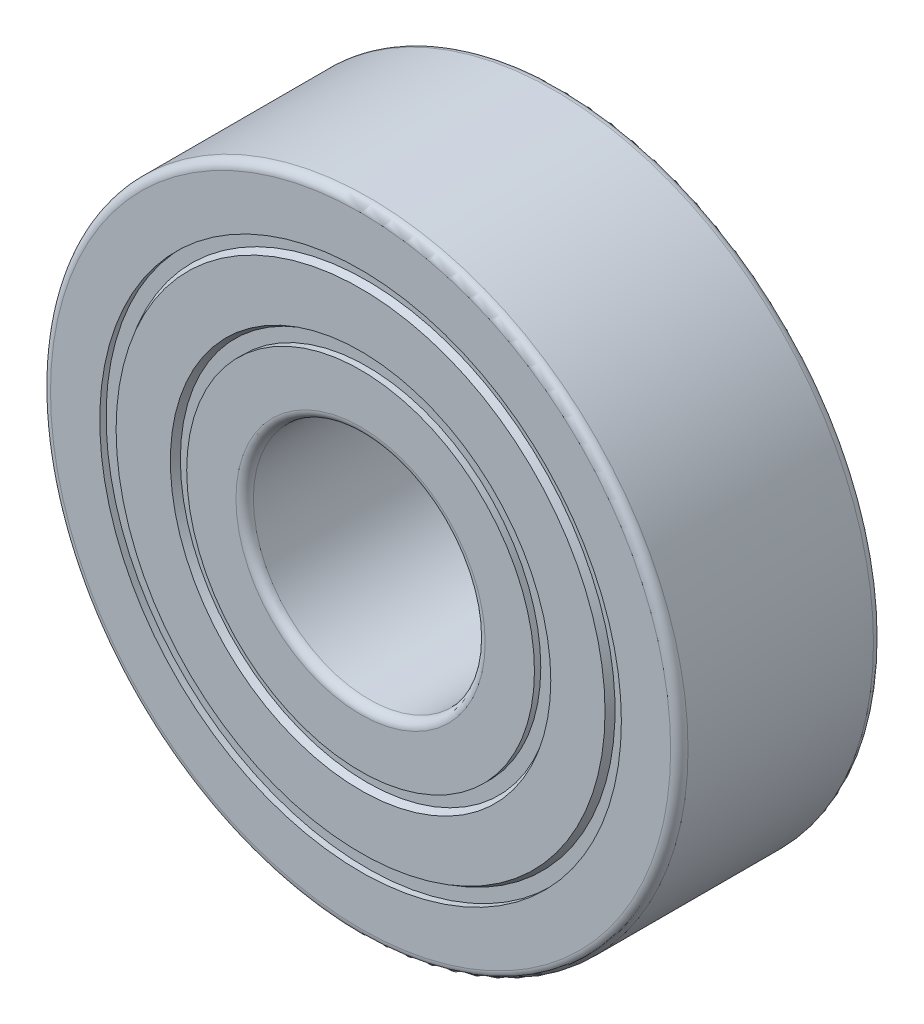
ISO-10303-21;
HEADER;
FILE_DESCRIPTION(('STEP AP214'),'2;1');
FILE_NAME('part.step','',(''),(''),'','','');
FILE_SCHEMA(('AUTOMOTIVE_DESIGN { 1 0 10303 214 1 1 1 1 }'));
ENDSEC;
DATA;
#1=APPLICATION_CONTEXT('core data for automotive mechanical design processes');
#2=APPLICATION_PROTOCOL_DEFINITION('international standard','automotive_design',2000,#1);
#3=PRODUCT_CONTEXT('',#1,'mechanical');
#4=PRODUCT('Part','Part','',(#3));
#5=PRODUCT_RELATED_PRODUCT_CATEGORY('part','',(#4));
#6=PRODUCT_DEFINITION_FORMATION('','',#4);
#7=PRODUCT_DEFINITION_CONTEXT('part definition',#1,'design');
#8=PRODUCT_DEFINITION('design','',#6,#7);
#9=PRODUCT_DEFINITION_SHAPE('','',#8);
#10=(LENGTH_UNIT() NAMED_UNIT(*) SI_UNIT(.MILLI.,.METRE.));
#11=(NAMED_UNIT(*) PLANE_ANGLE_UNIT() SI_UNIT($,.RADIAN.));
#12=(NAMED_UNIT(*) SI_UNIT($,.STERADIAN.) SOLID_ANGLE_UNIT());
#13=UNCERTAINTY_MEASURE_WITH_UNIT(LENGTH_MEASURE(1.E-05),#10,'distance_accuracy_value','');
#14=(GEOMETRIC_REPRESENTATION_CONTEXT(3) GLOBAL_UNCERTAINTY_ASSIGNED_CONTEXT((#13)) GLOBAL_UNIT_ASSIGNED_CONTEXT((#10,
#11,#12)) REPRESENTATION_CONTEXT('',''));
#15=CARTESIAN_POINT('',(0.,0.,0.));
#16=DIRECTION('',(0.,0.,1.));
#17=DIRECTION('',(1.,0.,0.));
#18=AXIS2_PLACEMENT_3D('',#15,#16,#17);
#19=CARTESIAN_POINT('',(0.,0.,19.));
#20=DIRECTION('',(0.,0.,1.));
#21=DIRECTION('',(1.,0.,0.));
#22=AXIS2_PLACEMENT_3D('',#19,#20,#21);
#23=CYLINDRICAL_SURFACE('',#22,4.);
#24=CARTESIAN_POINT('',(0.,0.,6.7));
#25=DIRECTION('',(0.,0.,1.));
#26=DIRECTION('',(1.,0.,0.));
#27=AXIS2_PLACEMENT_3D('',#24,#25,#26);
#28=CIRCLE('',#27,4.);
#29=CARTESIAN_POINT('',(4.,0.,6.7));
#30=VERTEX_POINT('',#29);
#31=EDGE_CURVE('E179',#30,#30,#28,.F.);
#32=ORIENTED_EDGE('',*,*,#31,.F.);
#33=EDGE_LOOP('',(#32));
#34=FACE_BOUND('',#33,.T.);
#35=CARTESIAN_POINT('',(0.,0.,0.300000000000002));
#36=DIRECTION('',(0.,0.,1.));
#37=DIRECTION('',(1.,0.,0.));
#38=AXIS2_PLACEMENT_3D('',#35,#36,#37);
#39=CIRCLE('',#38,4.);
#40=CARTESIAN_POINT('',(4.,0.,0.300000000000002));
#41=VERTEX_POINT('',#40);
#42=EDGE_CURVE('E176',#41,#41,#39,.T.);
#43=ORIENTED_EDGE('',*,*,#42,.F.);
#44=EDGE_LOOP('',(#43));
#45=FACE_BOUND('',#44,.T.);
#46=ADVANCED_FACE('F15',(#34,#45),#23,.F.);
#47=CARTESIAN_POINT('',(0.,0.,6.7));
#48=DIRECTION('',(0.,0.,1.));
#49=DIRECTION('',(1.,0.,0.));
#50=AXIS2_PLACEMENT_3D('',#47,#48,#49);
#51=TOROIDAL_SURFACE('',#50,4.3,0.3);
#52=CARTESIAN_POINT('',(0.,0.,7.));
#53=DIRECTION('',(0.,0.,1.));
#54=DIRECTION('',(-1.,0.,0.));
#55=AXIS2_PLACEMENT_3D('',#52,#53,#54);
#56=CIRCLE('',#55,4.3);
#57=CARTESIAN_POINT('',(-4.3,0.,7.));
#58=VERTEX_POINT('',#57);
#59=EDGE_CURVE('E175',#58,#58,#56,.T.);
#60=ORIENTED_EDGE('',*,*,#59,.T.);
#61=EDGE_LOOP('',(#60));
#62=FACE_BOUND('',#61,.T.);
#63=ORIENTED_EDGE('',*,*,#31,.T.);
#64=EDGE_LOOP('',(#63));
#65=FACE_BOUND('',#64,.T.);
#66=ADVANCED_FACE('F187',(#62,#65),#51,.T.);
#67=CARTESIAN_POINT('',(0.,0.,0.300000000000001));
#68=DIRECTION('',(0.,0.,1.));
#69=DIRECTION('',(1.,0.,0.));
#70=AXIS2_PLACEMENT_3D('',#67,#68,#69);
#71=TOROIDAL_SURFACE('',#70,4.3,0.3);
#72=ORIENTED_EDGE('',*,*,#42,.T.);
#73=EDGE_LOOP('',(#72));
#74=FACE_BOUND('',#73,.T.);
#75=CARTESIAN_POINT('',(0.,0.,0.));
#76=DIRECTION('',(0.,0.,-1.));
#77=DIRECTION('',(1.,0.,0.));
#78=AXIS2_PLACEMENT_3D('',#75,#76,#77);
#79=CIRCLE('',#78,4.3);
#80=CARTESIAN_POINT('',(4.3,0.,0.));
#81=VERTEX_POINT('',#80);
#82=EDGE_CURVE('E162',#81,#81,#79,.T.);
#83=ORIENTED_EDGE('',*,*,#82,.T.);
#84=EDGE_LOOP('',(#83));
#85=FACE_BOUND('',#84,.T.);
#86=ADVANCED_FACE('F183',(#74,#85),#71,.T.);
#87=CARTESIAN_POINT('',(-4.3,0.,7.));
#88=DIRECTION('',(0.,0.,-1.));
#89=DIRECTION('',(-1.,0.,0.));
#90=AXIS2_PLACEMENT_3D('',#87,#88,#89);
#91=PLANE('',#90);
#92=CARTESIAN_POINT('',(0.,0.,7.));
#93=DIRECTION('',(0.,0.,1.));
#94=DIRECTION('',(1.,0.,0.));
#95=AXIS2_PLACEMENT_3D('',#92,#93,#94);
#96=CIRCLE('',#95,6.);
#97=CARTESIAN_POINT('',(6.,0.,7.));
#98=VERTEX_POINT('',#97);
#99=EDGE_CURVE('E19',#98,#98,#96,.F.);
#100=ORIENTED_EDGE('',*,*,#99,.F.);
#101=EDGE_LOOP('',(#100));
#102=FACE_BOUND('',#101,.T.);
#103=ORIENTED_EDGE('',*,*,#59,.F.);
#104=EDGE_LOOP('',(#103));
#105=FACE_BOUND('',#104,.T.);
#106=ADVANCED_FACE('F147',(#102,#105),#91,.F.);
#107=CARTESIAN_POINT('',(-4.3,0.,0.));
#108=DIRECTION('',(0.,0.,1.));
#109=DIRECTION('',(1.,0.,0.));
#110=AXIS2_PLACEMENT_3D('',#107,#108,#109);
#111=PLANE('',#110);
#112=ORIENTED_EDGE('',*,*,#82,.F.);
#113=EDGE_LOOP('',(#112));
#114=FACE_BOUND('',#113,.T.);
#115=CARTESIAN_POINT('',(0.,0.,0.));
#116=DIRECTION('',(0.,0.,1.));
#117=DIRECTION('',(1.,0.,0.));
#118=AXIS2_PLACEMENT_3D('',#115,#116,#117);
#119=CIRCLE('',#118,6.);
#120=CARTESIAN_POINT('',(6.,0.,0.));
#121=VERTEX_POINT('',#120);
#122=EDGE_CURVE('E253',#121,#121,#119,.T.);
#123=ORIENTED_EDGE('',*,*,#122,.F.);
#124=EDGE_LOOP('',(#123));
#125=FACE_BOUND('',#124,.T.);
#126=ADVANCED_FACE('F142',(#114,#125),#111,.F.);
#127=CARTESIAN_POINT('',(0.,0.,19.));
#128=DIRECTION('',(0.,0.,1.));
#129=DIRECTION('',(1.,0.,0.));
#130=AXIS2_PLACEMENT_3D('',#127,#128,#129);
#131=CYLINDRICAL_SURFACE('',#130,6.);
#132=ORIENTED_EDGE('',*,*,#99,.T.);
#133=EDGE_LOOP('',(#132));
#134=FACE_BOUND('',#133,.T.);
#135=CARTESIAN_POINT('',(0.,0.,6.78125));
#136=DIRECTION('',(0.,0.,1.));
#137=DIRECTION('',(1.,0.,0.));
#138=AXIS2_PLACEMENT_3D('',#135,#136,#137);
#139=CIRCLE('',#138,6.);
#140=CARTESIAN_POINT('',(6.,0.,6.78125));
#141=VERTEX_POINT('',#140);
#142=EDGE_CURVE('E251',#141,#141,#139,.T.);
#143=ORIENTED_EDGE('',*,*,#142,.T.);
#144=EDGE_LOOP('',(#143));
#145=FACE_BOUND('',#144,.T.);
#146=ADVANCED_FACE('F138',(#134,#145),#131,.T.);
#147=CARTESIAN_POINT('',(0.,0.,19.));
#148=DIRECTION('',(0.,0.,1.));
#149=DIRECTION('',(1.,0.,0.));
#150=AXIS2_PLACEMENT_3D('',#147,#148,#149);
#151=CYLINDRICAL_SURFACE('',#150,6.);
#152=ORIENTED_EDGE('',*,*,#122,.T.);
#153=EDGE_LOOP('',(#152));
#154=FACE_BOUND('',#153,.T.);
#155=CARTESIAN_POINT('',(0.,0.,0.21875));
#156=DIRECTION('',(0.,0.,1.));
#157=DIRECTION('',(1.,0.,0.));
#158=AXIS2_PLACEMENT_3D('',#155,#156,#157);
#159=CIRCLE('',#158,6.);
#160=CARTESIAN_POINT('',(6.,0.,0.21875));
#161=VERTEX_POINT('',#160);
#162=EDGE_CURVE('E248',#161,#161,#159,.F.);
#163=ORIENTED_EDGE('',*,*,#162,.T.);
#164=EDGE_LOOP('',(#163));
#165=FACE_BOUND('',#164,.T.);
#166=ADVANCED_FACE('F134',(#154,#165),#151,.T.);
#167=CARTESIAN_POINT('',(-6.,0.,6.78125));
#168=DIRECTION('',(0.,0.,-1.));
#169=DIRECTION('',(-1.,0.,0.));
#170=AXIS2_PLACEMENT_3D('',#167,#168,#169);
#171=PLANE('',#170);
#172=CARTESIAN_POINT('',(0.,0.,6.78125000001728));
#173=DIRECTION('',(0.,0.,1.));
#174=DIRECTION('',(1.,0.,0.));
#175=AXIS2_PLACEMENT_3D('',#172,#173,#174);
#176=CIRCLE('',#175,6.43750000000409);
#177=CARTESIAN_POINT('',(6.43750000000409,0.,6.78125000001728));
#178=VERTEX_POINT('',#177);
#179=EDGE_CURVE('E245',#178,#178,#176,.T.);
#180=ORIENTED_EDGE('',*,*,#179,.T.);
#181=EDGE_LOOP('',(#180));
#182=FACE_BOUND('',#181,.T.);
#183=ORIENTED_EDGE('',*,*,#142,.F.);
#184=EDGE_LOOP('',(#183));
#185=FACE_BOUND('',#184,.T.);
#186=ADVANCED_FACE('F130',(#182,#185),#171,.F.);
#187=CARTESIAN_POINT('',(-6.,0.,0.21875));
#188=DIRECTION('',(0.,0.,1.));
#189=DIRECTION('',(1.,0.,0.));
#190=AXIS2_PLACEMENT_3D('',#187,#188,#189);
#191=PLANE('',#190);
#192=ORIENTED_EDGE('',*,*,#162,.F.);
#193=EDGE_LOOP('',(#192));
#194=FACE_BOUND('',#193,.T.);
#195=CARTESIAN_POINT('',(0.,0.,0.218750000044565));
#196=DIRECTION('',(0.,0.,-1.));
#197=DIRECTION('',(-1.,0.,0.));
#198=AXIS2_PLACEMENT_3D('',#195,#196,#197);
#199=CIRCLE('',#198,6.43749999998007);
#200=CARTESIAN_POINT('',(-6.43749999998007,0.,0.218750000044565));
#201=VERTEX_POINT('',#200);
#202=EDGE_CURVE('E242',#201,#201,#199,.T.);
#203=ORIENTED_EDGE('',*,*,#202,.T.);
#204=EDGE_LOOP('',(#203));
#205=FACE_BOUND('',#204,.T.);
#206=ADVANCED_FACE('F126',(#194,#205),#191,.F.);
#207=CARTESIAN_POINT('',(0.,0.,7.000000000005));
#208=DIRECTION('',(0.,0.,1.));
#209=DIRECTION('',(1.,0.,0.));
#210=AXIS2_PLACEMENT_3D('',#207,#208,#209);
#211=CONICAL_SURFACE('',#210,6.56379537139173,0.523598775630869);
#212=CARTESIAN_POINT('',(0.,0.,7.000000000005));
#213=DIRECTION('',(0.,0.,1.));
#214=DIRECTION('',(1.,0.,0.));
#215=AXIS2_PLACEMENT_3D('',#212,#213,#214);
#216=CIRCLE('',#215,6.56379537139173);
#217=CARTESIAN_POINT('',(6.56379537139173,0.,7.000000000005));
#218=VERTEX_POINT('',#217);
#219=EDGE_CURVE('E239',#218,#218,#216,.T.);
#220=ORIENTED_EDGE('',*,*,#219,.T.);
#221=EDGE_LOOP('',(#220));
#222=FACE_BOUND('',#221,.T.);
#223=ORIENTED_EDGE('',*,*,#179,.F.);
#224=EDGE_LOOP('',(#223));
#225=FACE_BOUND('',#224,.T.);
#226=ADVANCED_FACE('F122',(#222,#225),#211,.F.);
#227=CARTESIAN_POINT('',(0.,0.,0.));
#228=DIRECTION('',(0.,0.,-1.));
#229=DIRECTION('',(-1.,0.,0.));
#230=AXIS2_PLACEMENT_3D('',#227,#228,#229);
#231=CONICAL_SURFACE('',#230,6.56379537139173,0.523598775600719);
#232=ORIENTED_EDGE('',*,*,#202,.F.);
#233=EDGE_LOOP('',(#232));
#234=FACE_BOUND('',#233,.T.);
#235=CARTESIAN_POINT('',(0.,0.,0.));
#236=DIRECTION('',(0.,0.,-1.));
#237=DIRECTION('',(-1.,0.,0.));
#238=AXIS2_PLACEMENT_3D('',#235,#236,#237);
#239=CIRCLE('',#238,6.56379537139173);
#240=CARTESIAN_POINT('',(-6.56379537139173,0.,0.));
#241=VERTEX_POINT('',#240);
#242=EDGE_CURVE('E236',#241,#241,#239,.T.);
#243=ORIENTED_EDGE('',*,*,#242,.T.);
#244=EDGE_LOOP('',(#243));
#245=FACE_BOUND('',#244,.T.);
#246=ADVANCED_FACE('F118',(#234,#245),#231,.F.);
#247=CARTESIAN_POINT('',(-8.43620462861477,0.,7.));
#248=DIRECTION('',(0.,0.,-1.));
#249=DIRECTION('',(-1.,0.,0.));
#250=AXIS2_PLACEMENT_3D('',#247,#248,#249);
#251=PLANE('',#250);
#252=CARTESIAN_POINT('',(0.,0.,7.));
#253=DIRECTION('',(0.,0.,-1.));
#254=DIRECTION('',(-1.,0.,0.));
#255=AXIS2_PLACEMENT_3D('',#252,#253,#254);
#256=CIRCLE('',#255,8.43620462861477);
#257=CARTESIAN_POINT('',(-8.43620462861477,0.,7.));
#258=VERTEX_POINT('',#257);
#259=EDGE_CURVE('E233',#258,#258,#256,.T.);
#260=ORIENTED_EDGE('',*,*,#259,.F.);
#261=EDGE_LOOP('',(#260));
#262=FACE_BOUND('',#261,.T.);
#263=ORIENTED_EDGE('',*,*,#219,.F.);
#264=EDGE_LOOP('',(#263));
#265=FACE_BOUND('',#264,.T.);
#266=ADVANCED_FACE('F114',(#262,#265),#251,.F.);
#267=CARTESIAN_POINT('',(-8.43620462861477,0.,0.));
#268=DIRECTION('',(0.,0.,1.));
#269=DIRECTION('',(1.,0.,0.));
#270=AXIS2_PLACEMENT_3D('',#267,#268,#269);
#271=PLANE('',#270);
#272=ORIENTED_EDGE('',*,*,#242,.F.);
#273=EDGE_LOOP('',(#272));
#274=FACE_BOUND('',#273,.T.);
#275=CARTESIAN_POINT('',(0.,0.,0.));
#276=DIRECTION('',(0.,0.,1.));
#277=DIRECTION('',(1.,0.,0.));
#278=AXIS2_PLACEMENT_3D('',#275,#276,#277);
#279=CIRCLE('',#278,8.43620462861477);
#280=CARTESIAN_POINT('',(8.43620462861477,0.,0.));
#281=VERTEX_POINT('',#280);
#282=EDGE_CURVE('E230',#281,#281,#279,.T.);
#283=ORIENTED_EDGE('',*,*,#282,.F.);
#284=EDGE_LOOP('',(#283));
#285=FACE_BOUND('',#284,.T.);
#286=ADVANCED_FACE('F110',(#274,#285),#271,.F.);
#287=CARTESIAN_POINT('',(0.,0.,6.78125));
#288=DIRECTION('',(0.,0.,-1.));
#289=DIRECTION('',(-1.,0.,0.));
#290=AXIS2_PLACEMENT_3D('',#287,#288,#289);
#291=CONICAL_SURFACE('',#290,8.5625,0.523598775598308);
#292=CARTESIAN_POINT('',(0.,0.,6.78125));
#293=DIRECTION('',(0.,0.,-1.));
#294=DIRECTION('',(-1.,0.,0.));
#295=AXIS2_PLACEMENT_3D('',#292,#293,#294);
#296=CIRCLE('',#295,8.5625);
#297=CARTESIAN_POINT('',(-8.5625,0.,6.78125));
#298=VERTEX_POINT('',#297);
#299=EDGE_CURVE('E227',#298,#298,#296,.F.);
#300=ORIENTED_EDGE('',*,*,#299,.T.);
#301=EDGE_LOOP('',(#300));
#302=FACE_BOUND('',#301,.T.);
#303=ORIENTED_EDGE('',*,*,#259,.T.);
#304=EDGE_LOOP('',(#303));
#305=FACE_BOUND('',#304,.T.);
#306=ADVANCED_FACE('F106',(#302,#305),#291,.T.);
#307=CARTESIAN_POINT('',(0.,0.,0.21875));
#308=DIRECTION('',(0.,0.,1.));
#309=DIRECTION('',(1.,0.,0.));
#310=AXIS2_PLACEMENT_3D('',#307,#308,#309);
#311=CONICAL_SURFACE('',#310,8.5625,0.523598775598309);
#312=ORIENTED_EDGE('',*,*,#282,.T.);
#313=EDGE_LOOP('',(#312));
#314=FACE_BOUND('',#313,.T.);
#315=CARTESIAN_POINT('',(0.,0.,0.21875));
#316=DIRECTION('',(0.,0.,1.));
#317=DIRECTION('',(1.,0.,0.));
#318=AXIS2_PLACEMENT_3D('',#315,#316,#317);
#319=CIRCLE('',#318,8.5625);
#320=CARTESIAN_POINT('',(8.5625,0.,0.21875));
#321=VERTEX_POINT('',#320);
#322=EDGE_CURVE('E224',#321,#321,#319,.F.);
#323=ORIENTED_EDGE('',*,*,#322,.T.);
#324=EDGE_LOOP('',(#323));
#325=FACE_BOUND('',#324,.T.);
#326=ADVANCED_FACE('F102',(#314,#325),#311,.T.);
#327=CARTESIAN_POINT('',(-9.,0.,6.78125));
#328=DIRECTION('',(0.,0.,-1.));
#329=DIRECTION('',(-1.,0.,0.));
#330=AXIS2_PLACEMENT_3D('',#327,#328,#329);
#331=PLANE('',#330);
#332=CARTESIAN_POINT('',(0.,0.,6.78125));
#333=DIRECTION('',(0.,0.,1.));
#334=DIRECTION('',(1.,0.,0.));
#335=AXIS2_PLACEMENT_3D('',#332,#333,#334);
#336=CIRCLE('',#335,9.);
#337=CARTESIAN_POINT('',(9.,0.,6.78125));
#338=VERTEX_POINT('',#337);
#339=EDGE_CURVE('E221',#338,#338,#336,.T.);
#340=ORIENTED_EDGE('',*,*,#339,.T.);
#341=EDGE_LOOP('',(#340));
#342=FACE_BOUND('',#341,.T.);
#343=ORIENTED_EDGE('',*,*,#299,.F.);
#344=EDGE_LOOP('',(#343));
#345=FACE_BOUND('',#344,.T.);
#346=ADVANCED_FACE('F98',(#342,#345),#331,.F.);
#347=CARTESIAN_POINT('',(-9.,0.,0.21875));
#348=DIRECTION('',(0.,0.,1.));
#349=DIRECTION('',(1.,0.,0.));
#350=AXIS2_PLACEMENT_3D('',#347,#348,#349);
#351=PLANE('',#350);
#352=ORIENTED_EDGE('',*,*,#322,.F.);
#353=EDGE_LOOP('',(#352));
#354=FACE_BOUND('',#353,.T.);
#355=CARTESIAN_POINT('',(0.,0.,0.21875));
#356=DIRECTION('',(0.,0.,1.));
#357=DIRECTION('',(1.,0.,0.));
#358=AXIS2_PLACEMENT_3D('',#355,#356,#357);
#359=CIRCLE('',#358,9.);
#360=CARTESIAN_POINT('',(9.,0.,0.21875));
#361=VERTEX_POINT('',#360);
#362=EDGE_CURVE('E218',#361,#361,#359,.F.);
#363=ORIENTED_EDGE('',*,*,#362,.T.);
#364=EDGE_LOOP('',(#363));
#365=FACE_BOUND('',#364,.T.);
#366=ADVANCED_FACE('F94',(#354,#365),#351,.F.);
#367=CARTESIAN_POINT('',(0.,0.,19.));
#368=DIRECTION('',(0.,0.,1.));
#369=DIRECTION('',(1.,0.,0.));
#370=AXIS2_PLACEMENT_3D('',#367,#368,#369);
#371=CYLINDRICAL_SURFACE('',#370,9.);
#372=CARTESIAN_POINT('',(0.,0.,7.));
#373=DIRECTION('',(0.,0.,1.));
#374=DIRECTION('',(1.,0.,0.));
#375=AXIS2_PLACEMENT_3D('',#372,#373,#374);
#376=CIRCLE('',#375,9.);
#377=CARTESIAN_POINT('',(9.,0.,7.));
#378=VERTEX_POINT('',#377);
#379=EDGE_CURVE('E215',#378,#378,#376,.T.);
#380=ORIENTED_EDGE('',*,*,#379,.T.);
#381=EDGE_LOOP('',(#380));
#382=FACE_BOUND('',#381,.T.);
#383=ORIENTED_EDGE('',*,*,#339,.F.);
#384=EDGE_LOOP('',(#383));
#385=FACE_BOUND('',#384,.T.);
#386=ADVANCED_FACE('F90',(#382,#385),#371,.F.);
#387=CARTESIAN_POINT('',(0.,0.,19.));
#388=DIRECTION('',(0.,0.,1.));
#389=DIRECTION('',(1.,0.,0.));
#390=AXIS2_PLACEMENT_3D('',#387,#388,#389);
#391=CYLINDRICAL_SURFACE('',#390,9.);
#392=ORIENTED_EDGE('',*,*,#362,.F.);
#393=EDGE_LOOP('',(#392));
#394=FACE_BOUND('',#393,.T.);
#395=CARTESIAN_POINT('',(0.,0.,0.));
#396=DIRECTION('',(0.,0.,1.));
#397=DIRECTION('',(1.,0.,0.));
#398=AXIS2_PLACEMENT_3D('',#395,#396,#397);
#399=CIRCLE('',#398,9.);
#400=CARTESIAN_POINT('',(9.,0.,0.));
#401=VERTEX_POINT('',#400);
#402=EDGE_CURVE('E206',#401,#401,#399,.F.);
#403=ORIENTED_EDGE('',*,*,#402,.T.);
#404=EDGE_LOOP('',(#403));
#405=FACE_BOUND('',#404,.T.);
#406=ADVANCED_FACE('F86',(#394,#405),#391,.F.);
#407=CARTESIAN_POINT('',(-9.,0.,7.));
#408=DIRECTION('',(0.,0.,-1.));
#409=DIRECTION('',(-1.,0.,0.));
#410=AXIS2_PLACEMENT_3D('',#407,#408,#409);
#411=PLANE('',#410);
#412=CARTESIAN_POINT('',(0.,0.,7.));
#413=DIRECTION('',(0.,0.,-1.));
#414=DIRECTION('',(1.,0.,0.));
#415=AXIS2_PLACEMENT_3D('',#412,#413,#414);
#416=CIRCLE('',#415,10.7);
#417=CARTESIAN_POINT('',(10.7,0.,7.));
#418=VERTEX_POINT('',#417);
#419=EDGE_CURVE('E214',#418,#418,#416,.T.);
#420=ORIENTED_EDGE('',*,*,#419,.F.);
#421=EDGE_LOOP('',(#420));
#422=FACE_BOUND('',#421,.T.);
#423=ORIENTED_EDGE('',*,*,#379,.F.);
#424=EDGE_LOOP('',(#423));
#425=FACE_BOUND('',#424,.T.);
#426=ADVANCED_FACE('F77',(#422,#425),#411,.F.);
#427=CARTESIAN_POINT('',(-9.,0.,0.));
#428=DIRECTION('',(0.,0.,1.));
#429=DIRECTION('',(1.,0.,0.));
#430=AXIS2_PLACEMENT_3D('',#427,#428,#429);
#431=PLANE('',#430);
#432=ORIENTED_EDGE('',*,*,#402,.F.);
#433=EDGE_LOOP('',(#432));
#434=FACE_BOUND('',#433,.T.);
#435=CARTESIAN_POINT('',(0.,0.,0.));
#436=DIRECTION('',(0.,0.,1.));
#437=DIRECTION('',(-1.,0.,0.));
#438=AXIS2_PLACEMENT_3D('',#435,#436,#437);
#439=CIRCLE('',#438,10.7);
#440=CARTESIAN_POINT('',(-10.7,0.,0.));
#441=VERTEX_POINT('',#440);
#442=EDGE_CURVE('E28',#441,#441,#439,.T.);
#443=ORIENTED_EDGE('',*,*,#442,.F.);
#444=EDGE_LOOP('',(#443));
#445=FACE_BOUND('',#444,.T.);
#446=ADVANCED_FACE('F56',(#434,#445),#431,.F.);
#447=CARTESIAN_POINT('',(0.,0.,6.7));
#448=DIRECTION('',(0.,0.,1.));
#449=DIRECTION('',(1.,0.,0.));
#450=AXIS2_PLACEMENT_3D('',#447,#448,#449);
#451=TOROIDAL_SURFACE('',#450,10.7,0.3);
#452=CARTESIAN_POINT('',(0.,0.,6.7));
#453=DIRECTION('',(0.,0.,1.));
#454=DIRECTION('',(1.,0.,0.));
#455=AXIS2_PLACEMENT_3D('',#452,#453,#454);
#456=CIRCLE('',#455,11.);
#457=CARTESIAN_POINT('',(11.,0.,6.7));
#458=VERTEX_POINT('',#457);
#459=EDGE_CURVE('E23',#458,#458,#456,.F.);
#460=ORIENTED_EDGE('',*,*,#459,.F.);
#461=EDGE_LOOP('',(#460));
#462=FACE_BOUND('',#461,.T.);
#463=ORIENTED_EDGE('',*,*,#419,.T.);
#464=EDGE_LOOP('',(#463));
#465=FACE_BOUND('',#464,.T.);
#466=ADVANCED_FACE('F52',(#462,#465),#451,.T.);
#467=CARTESIAN_POINT('',(0.,0.,0.299999999999999));
#468=DIRECTION('',(0.,0.,1.));
#469=DIRECTION('',(1.,0.,0.));
#470=AXIS2_PLACEMENT_3D('',#467,#468,#469);
#471=TOROIDAL_SURFACE('',#470,10.7,0.3);
#472=ORIENTED_EDGE('',*,*,#442,.T.);
#473=EDGE_LOOP('',(#472));
#474=FACE_BOUND('',#473,.T.);
#475=CARTESIAN_POINT('',(0.,0.,0.299999999999998));
#476=DIRECTION('',(0.,0.,1.));
#477=DIRECTION('',(1.,0.,0.));
#478=AXIS2_PLACEMENT_3D('',#475,#476,#477);
#479=CIRCLE('',#478,11.);
#480=CARTESIAN_POINT('',(11.,0.,0.299999999999998));
#481=VERTEX_POINT('',#480);
#482=EDGE_CURVE('E10',#481,#481,#479,.T.);
#483=ORIENTED_EDGE('',*,*,#482,.F.);
#484=EDGE_LOOP('',(#483));
#485=FACE_BOUND('',#484,.T.);
#486=ADVANCED_FACE('F43',(#474,#485),#471,.T.);
#487=CARTESIAN_POINT('',(0.,0.,19.));
#488=DIRECTION('',(0.,0.,1.));
#489=DIRECTION('',(1.,0.,0.));
#490=AXIS2_PLACEMENT_3D('',#487,#488,#489);
#491=CYLINDRICAL_SURFACE('',#490,11.);
#492=ORIENTED_EDGE('',*,*,#459,.T.);
#493=EDGE_LOOP('',(#492));
#494=FACE_BOUND('',#493,.T.);
#495=ORIENTED_EDGE('',*,*,#482,.T.);
#496=EDGE_LOOP('',(#495));
#497=FACE_BOUND('',#496,.T.);
#498=ADVANCED_FACE('F17',(#494,#497),#491,.T.);
#499=CLOSED_SHELL('',(#46,#66,#86,#106,#126,#146,#166,#186,#206,#226,#246,#266,#286,#306,#326,
#346,#366,#386,#406,#426,#446,#466,#486,#498));
#500=CARTESIAN_POINT('',(0.,0.,3.5));
#501=DIRECTION('',(0.,0.,1.));
#502=DIRECTION('',(1.,0.,0.));
#503=AXIS2_PLACEMENT_3D('',#500,#501,#502);
#504=TOROIDAL_SURFACE('',#503,7.5,2.1875);
#505=ADVANCED_FACE('F294',(),#504,.F.);
#506=CLOSED_SHELL('',(#505));
#507=ORIENTED_CLOSED_SHELL('',*,#506,.T.);
#508=BREP_WITH_VOIDS('B1',#499,(#507));
#509=ADVANCED_BREP_SHAPE_REPRESENTATION('',(#18,#508),#14);
#510=SHAPE_DEFINITION_REPRESENTATION(#9,#509);
ENDSEC;
END-ISO-10303-21;
